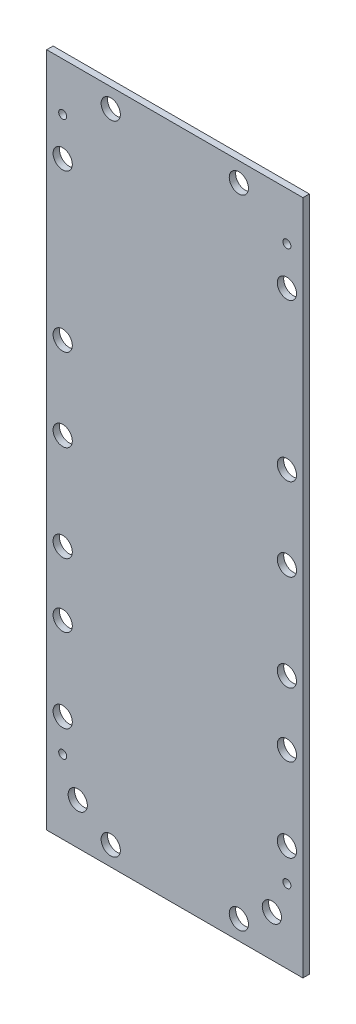
ISO-10303-21;
HEADER;
FILE_DESCRIPTION(('STEP AP214'),'2;1');
FILE_NAME('part.step','',(''),(''),'','','');
FILE_SCHEMA(('AUTOMOTIVE_DESIGN { 1 0 10303 214 1 1 1 1 }'));
ENDSEC;
DATA;
#1=APPLICATION_CONTEXT('core data for automotive mechanical design processes');
#2=APPLICATION_PROTOCOL_DEFINITION('international standard','automotive_design',2000,#1);
#3=PRODUCT_CONTEXT('',#1,'mechanical');
#4=PRODUCT('Part','Part','',(#3));
#5=PRODUCT_RELATED_PRODUCT_CATEGORY('part','',(#4));
#6=PRODUCT_DEFINITION_FORMATION('','',#4);
#7=PRODUCT_DEFINITION_CONTEXT('part definition',#1,'design');
#8=PRODUCT_DEFINITION('design','',#6,#7);
#9=PRODUCT_DEFINITION_SHAPE('','',#8);
#10=(LENGTH_UNIT() NAMED_UNIT(*) SI_UNIT(.MILLI.,.METRE.));
#11=(NAMED_UNIT(*) PLANE_ANGLE_UNIT() SI_UNIT($,.RADIAN.));
#12=(NAMED_UNIT(*) SI_UNIT($,.STERADIAN.) SOLID_ANGLE_UNIT());
#13=UNCERTAINTY_MEASURE_WITH_UNIT(LENGTH_MEASURE(1.E-05),#10,'distance_accuracy_value','');
#14=(GEOMETRIC_REPRESENTATION_CONTEXT(3) GLOBAL_UNCERTAINTY_ASSIGNED_CONTEXT((#13)) GLOBAL_UNIT_ASSIGNED_CONTEXT((#10,
#11,#12)) REPRESENTATION_CONTEXT('',''));
#15=CARTESIAN_POINT('',(0.,0.,0.));
#16=DIRECTION('',(0.,0.,1.));
#17=DIRECTION('',(1.,0.,0.));
#18=AXIS2_PLACEMENT_3D('',#15,#16,#17);
#19=CARTESIAN_POINT('',(80.,0.,2.));
#20=DIRECTION('',(0.,1.,0.));
#21=DIRECTION('',(0.,0.,1.));
#22=AXIS2_PLACEMENT_3D('',#19,#20,#21);
#23=PLANE('',#22);
#24=DIRECTION('',(1.,0.,0.));
#25=VECTOR('',#24,1.);
#26=CARTESIAN_POINT('',(80.,0.,0.));
#27=LINE('',#26,#25);
#28=CARTESIAN_POINT('',(0.,0.,0.));
#29=VERTEX_POINT('',#28);
#30=CARTESIAN_POINT('',(80.,0.,0.));
#31=VERTEX_POINT('',#30);
#32=EDGE_CURVE('E104',#29,#31,#27,.T.);
#33=ORIENTED_EDGE('',*,*,#32,.T.);
#34=DIRECTION('',(0.,0.,-1.));
#35=VECTOR('',#34,1.);
#36=CARTESIAN_POINT('',(80.,0.,2.));
#37=LINE('',#36,#35);
#38=CARTESIAN_POINT('',(80.,0.,2.));
#39=VERTEX_POINT('',#38);
#40=EDGE_CURVE('E11',#39,#31,#37,.T.);
#41=ORIENTED_EDGE('',*,*,#40,.F.);
#42=DIRECTION('',(1.,0.,0.));
#43=VECTOR('',#42,1.);
#44=CARTESIAN_POINT('',(80.,0.,2.));
#45=LINE('',#44,#43);
#46=CARTESIAN_POINT('',(0.,0.,2.));
#47=VERTEX_POINT('',#46);
#48=EDGE_CURVE('E91',#47,#39,#45,.T.);
#49=ORIENTED_EDGE('',*,*,#48,.F.);
#50=DIRECTION('',(0.,0.,-1.));
#51=VECTOR('',#50,1.);
#52=CARTESIAN_POINT('',(0.,0.,2.));
#53=LINE('',#52,#51);
#54=EDGE_CURVE('E100',#47,#29,#53,.T.);
#55=ORIENTED_EDGE('',*,*,#54,.T.);
#56=EDGE_LOOP('',(#33,#41,#49,#55));
#57=FACE_BOUND('',#56,.T.);
#58=ADVANCED_FACE('F38',(#57),#23,.F.);
#59=CARTESIAN_POINT('',(80.,211.,2.));
#60=DIRECTION('',(-1.,0.,0.));
#61=DIRECTION('',(0.,0.,1.));
#62=AXIS2_PLACEMENT_3D('',#59,#60,#61);
#63=PLANE('',#62);
#64=DIRECTION('',(0.,1.,0.));
#65=VECTOR('',#64,1.);
#66=CARTESIAN_POINT('',(80.,211.,0.));
#67=LINE('',#66,#65);
#68=CARTESIAN_POINT('',(80.,211.,0.));
#69=VERTEX_POINT('',#68);
#70=EDGE_CURVE('E95',#31,#69,#67,.T.);
#71=ORIENTED_EDGE('',*,*,#70,.T.);
#72=DIRECTION('',(0.,0.,-1.));
#73=VECTOR('',#72,1.);
#74=CARTESIAN_POINT('',(80.,211.,2.));
#75=LINE('',#74,#73);
#76=CARTESIAN_POINT('',(80.,211.,2.));
#77=VERTEX_POINT('',#76);
#78=EDGE_CURVE('E47',#77,#69,#75,.T.);
#79=ORIENTED_EDGE('',*,*,#78,.F.);
#80=DIRECTION('',(0.,1.,0.));
#81=VECTOR('',#80,1.);
#82=CARTESIAN_POINT('',(80.,211.,2.));
#83=LINE('',#82,#81);
#84=EDGE_CURVE('E86',#39,#77,#83,.T.);
#85=ORIENTED_EDGE('',*,*,#84,.F.);
#86=ORIENTED_EDGE('',*,*,#40,.T.);
#87=EDGE_LOOP('',(#71,#79,#85,#86));
#88=FACE_BOUND('',#87,.T.);
#89=ADVANCED_FACE('F94',(#88),#63,.F.);
#90=CARTESIAN_POINT('',(0.,211.,2.));
#91=DIRECTION('',(0.,-1.,0.));
#92=DIRECTION('',(0.,0.,-1.));
#93=AXIS2_PLACEMENT_3D('',#90,#91,#92);
#94=PLANE('',#93);
#95=DIRECTION('',(-1.,0.,0.));
#96=VECTOR('',#95,1.);
#97=CARTESIAN_POINT('',(0.,211.,0.));
#98=LINE('',#97,#96);
#99=CARTESIAN_POINT('',(0.,211.,0.));
#100=VERTEX_POINT('',#99);
#101=EDGE_CURVE('E73',#69,#100,#98,.T.);
#102=ORIENTED_EDGE('',*,*,#101,.T.);
#103=DIRECTION('',(0.,0.,-1.));
#104=VECTOR('',#103,1.);
#105=CARTESIAN_POINT('',(0.,211.,2.));
#106=LINE('',#105,#104);
#107=CARTESIAN_POINT('',(0.,211.,2.));
#108=VERTEX_POINT('',#107);
#109=EDGE_CURVE('E96',#108,#100,#106,.T.);
#110=ORIENTED_EDGE('',*,*,#109,.F.);
#111=DIRECTION('',(-1.,0.,0.));
#112=VECTOR('',#111,1.);
#113=CARTESIAN_POINT('',(0.,211.,2.));
#114=LINE('',#113,#112);
#115=EDGE_CURVE('E89',#77,#108,#114,.T.);
#116=ORIENTED_EDGE('',*,*,#115,.F.);
#117=ORIENTED_EDGE('',*,*,#78,.T.);
#118=EDGE_LOOP('',(#102,#110,#116,#117));
#119=FACE_BOUND('',#118,.T.);
#120=ADVANCED_FACE('F98',(#119),#94,.F.);
#121=CARTESIAN_POINT('',(0.,0.,2.));
#122=DIRECTION('',(1.,0.,0.));
#123=DIRECTION('',(0.,0.,-1.));
#124=AXIS2_PLACEMENT_3D('',#121,#122,#123);
#125=PLANE('',#124);
#126=DIRECTION('',(0.,-1.,0.));
#127=VECTOR('',#126,1.);
#128=CARTESIAN_POINT('',(0.,0.,0.));
#129=LINE('',#128,#127);
#130=EDGE_CURVE('E79',#100,#29,#129,.T.);
#131=ORIENTED_EDGE('',*,*,#130,.T.);
#132=ORIENTED_EDGE('',*,*,#54,.F.);
#133=DIRECTION('',(0.,-1.,0.));
#134=VECTOR('',#133,1.);
#135=CARTESIAN_POINT('',(0.,0.,2.));
#136=LINE('',#135,#134);
#137=EDGE_CURVE('E56',#108,#47,#136,.T.);
#138=ORIENTED_EDGE('',*,*,#137,.F.);
#139=ORIENTED_EDGE('',*,*,#109,.T.);
#140=EDGE_LOOP('',(#131,#132,#138,#139));
#141=FACE_BOUND('',#140,.T.);
#142=ADVANCED_FACE('F156',(#141),#125,.F.);
#143=CARTESIAN_POINT('',(0.,0.,2.));
#144=DIRECTION('',(0.,0.,-1.));
#145=DIRECTION('',(-1.,0.,0.));
#146=AXIS2_PLACEMENT_3D('',#143,#144,#145);
#147=PLANE('',#146);
#148=CARTESIAN_POINT('',(20.,205.,2.));
#149=DIRECTION('',(0.,0.,-1.));
#150=DIRECTION('',(-1.,0.,0.));
#151=AXIS2_PLACEMENT_3D('',#148,#149,#150);
#152=CIRCLE('',#151,3.);
#153=CARTESIAN_POINT('',(17.,205.,2.));
#154=VERTEX_POINT('',#153);
#155=EDGE_CURVE('E407',#154,#154,#152,.F.);
#156=ORIENTED_EDGE('',*,*,#155,.F.);
#157=EDGE_LOOP('',(#156));
#158=FACE_BOUND('',#157,.T.);
#159=CARTESIAN_POINT('',(4.99999999999998,33.2,2.));
#160=DIRECTION('',(0.,0.,-1.));
#161=DIRECTION('',(-1.,0.,0.));
#162=AXIS2_PLACEMENT_3D('',#159,#160,#161);
#163=CIRCLE('',#162,3.);
#164=CARTESIAN_POINT('',(1.99999999999998,33.2,2.));
#165=VERTEX_POINT('',#164);
#166=EDGE_CURVE('E419',#165,#165,#163,.F.);
#167=ORIENTED_EDGE('',*,*,#166,.F.);
#168=EDGE_LOOP('',(#167));
#169=FACE_BOUND('',#168,.T.);
#170=CARTESIAN_POINT('',(4.99999999999999,59.2,2.));
#171=DIRECTION('',(0.,0.,-1.));
#172=DIRECTION('',(-1.,0.,0.));
#173=AXIS2_PLACEMENT_3D('',#170,#171,#172);
#174=CIRCLE('',#173,3.);
#175=CARTESIAN_POINT('',(1.99999999999998,59.2,2.));
#176=VERTEX_POINT('',#175);
#177=EDGE_CURVE('E426',#176,#176,#174,.F.);
#178=ORIENTED_EDGE('',*,*,#177,.F.);
#179=EDGE_LOOP('',(#178));
#180=FACE_BOUND('',#179,.T.);
#181=CARTESIAN_POINT('',(5.00000000000002,79.2,2.));
#182=DIRECTION('',(0.,0.,-1.));
#183=DIRECTION('',(-1.,0.,0.));
#184=AXIS2_PLACEMENT_3D('',#181,#182,#183);
#185=CIRCLE('',#184,3.);
#186=CARTESIAN_POINT('',(2.00000000000001,79.2,2.));
#187=VERTEX_POINT('',#186);
#188=EDGE_CURVE('E425',#187,#187,#185,.F.);
#189=ORIENTED_EDGE('',*,*,#188,.F.);
#190=EDGE_LOOP('',(#189));
#191=FACE_BOUND('',#190,.T.);
#192=CARTESIAN_POINT('',(60.,5.99999999999999,2.));
#193=DIRECTION('',(0.,0.,-1.));
#194=DIRECTION('',(-1.,0.,0.));
#195=AXIS2_PLACEMENT_3D('',#192,#193,#194);
#196=CIRCLE('',#195,3.);
#197=CARTESIAN_POINT('',(57.,5.99999999999999,2.));
#198=VERTEX_POINT('',#197);
#199=EDGE_CURVE('E411',#198,#198,#196,.F.);
#200=ORIENTED_EDGE('',*,*,#199,.F.);
#201=EDGE_LOOP('',(#200));
#202=FACE_BOUND('',#201,.T.);
#203=CARTESIAN_POINT('',(20.,5.99999999999999,2.));
#204=DIRECTION('',(0.,0.,-1.));
#205=DIRECTION('',(-1.,0.,0.));
#206=AXIS2_PLACEMENT_3D('',#203,#204,#205);
#207=CIRCLE('',#206,2.99999999999999);
#208=CARTESIAN_POINT('',(17.,5.99999999999999,2.));
#209=VERTEX_POINT('',#208);
#210=EDGE_CURVE('E535',#209,#209,#207,.F.);
#211=ORIENTED_EDGE('',*,*,#210,.F.);
#212=EDGE_LOOP('',(#211));
#213=FACE_BOUND('',#212,.T.);
#214=CARTESIAN_POINT('',(70.3,13.,2.));
#215=DIRECTION('',(0.,0.,-1.));
#216=DIRECTION('',(-1.,0.,0.));
#217=AXIS2_PLACEMENT_3D('',#214,#215,#216);
#218=CIRCLE('',#217,3.00000000000001);
#219=CARTESIAN_POINT('',(67.3,13.,2.));
#220=VERTEX_POINT('',#219);
#221=EDGE_CURVE('E540',#220,#220,#218,.F.);
#222=ORIENTED_EDGE('',*,*,#221,.F.);
#223=EDGE_LOOP('',(#222));
#224=FACE_BOUND('',#223,.T.);
#225=CARTESIAN_POINT('',(60.,205.,2.));
#226=DIRECTION('',(0.,0.,-1.));
#227=DIRECTION('',(-1.,0.,0.));
#228=AXIS2_PLACEMENT_3D('',#225,#226,#227);
#229=CIRCLE('',#228,3.);
#230=CARTESIAN_POINT('',(57.,205.,2.));
#231=VERTEX_POINT('',#230);
#232=EDGE_CURVE('E529',#231,#231,#229,.F.);
#233=ORIENTED_EDGE('',*,*,#232,.F.);
#234=EDGE_LOOP('',(#233));
#235=FACE_BOUND('',#234,.T.);
#236=CARTESIAN_POINT('',(75.,135.,2.));
#237=DIRECTION('',(0.,0.,-1.));
#238=DIRECTION('',(-1.,0.,0.));
#239=AXIS2_PLACEMENT_3D('',#236,#237,#238);
#240=CIRCLE('',#239,3.00000000000001);
#241=CARTESIAN_POINT('',(72.,135.,2.));
#242=VERTEX_POINT('',#241);
#243=EDGE_CURVE('E462',#242,#242,#240,.F.);
#244=ORIENTED_EDGE('',*,*,#243,.F.);
#245=EDGE_LOOP('',(#244));
#246=FACE_BOUND('',#245,.T.);
#247=CARTESIAN_POINT('',(75.,109.2,2.));
#248=DIRECTION('',(0.,0.,-1.));
#249=DIRECTION('',(-1.,0.,0.));
#250=AXIS2_PLACEMENT_3D('',#247,#248,#249);
#251=CIRCLE('',#250,3.00000000000001);
#252=CARTESIAN_POINT('',(72.,109.2,2.));
#253=VERTEX_POINT('',#252);
#254=EDGE_CURVE('E463',#253,#253,#251,.F.);
#255=ORIENTED_EDGE('',*,*,#254,.F.);
#256=EDGE_LOOP('',(#255));
#257=FACE_BOUND('',#256,.T.);
#258=CARTESIAN_POINT('',(75.,79.2,2.));
#259=DIRECTION('',(0.,0.,-1.));
#260=DIRECTION('',(-1.,0.,0.));
#261=AXIS2_PLACEMENT_3D('',#258,#259,#260);
#262=CIRCLE('',#261,3.00000000000001);
#263=CARTESIAN_POINT('',(72.,79.2,2.));
#264=VERTEX_POINT('',#263);
#265=EDGE_CURVE('E470',#264,#264,#262,.F.);
#266=ORIENTED_EDGE('',*,*,#265,.F.);
#267=EDGE_LOOP('',(#266));
#268=FACE_BOUND('',#267,.T.);
#269=CARTESIAN_POINT('',(75.,59.2,2.));
#270=DIRECTION('',(0.,0.,-1.));
#271=DIRECTION('',(-1.,0.,0.));
#272=AXIS2_PLACEMENT_3D('',#269,#270,#271);
#273=CIRCLE('',#272,3.00000000000001);
#274=CARTESIAN_POINT('',(72.,59.2,2.));
#275=VERTEX_POINT('',#274);
#276=EDGE_CURVE('E476',#275,#275,#273,.F.);
#277=ORIENTED_EDGE('',*,*,#276,.F.);
#278=EDGE_LOOP('',(#277));
#279=FACE_BOUND('',#278,.T.);
#280=CARTESIAN_POINT('',(5.00000000000002,109.2,2.));
#281=DIRECTION('',(0.,0.,-1.));
#282=DIRECTION('',(-1.,0.,0.));
#283=AXIS2_PLACEMENT_3D('',#280,#281,#282);
#284=CIRCLE('',#283,3.);
#285=CARTESIAN_POINT('',(2.00000000000002,109.2,2.));
#286=VERTEX_POINT('',#285);
#287=EDGE_CURVE('E439',#286,#286,#284,.F.);
#288=ORIENTED_EDGE('',*,*,#287,.F.);
#289=EDGE_LOOP('',(#288));
#290=FACE_BOUND('',#289,.T.);
#291=CARTESIAN_POINT('',(4.99999999999999,135.,2.));
#292=DIRECTION('',(0.,0.,-1.));
#293=DIRECTION('',(-1.,0.,0.));
#294=AXIS2_PLACEMENT_3D('',#291,#292,#293);
#295=CIRCLE('',#294,3.);
#296=CARTESIAN_POINT('',(1.99999999999999,135.,2.));
#297=VERTEX_POINT('',#296);
#298=EDGE_CURVE('E438',#297,#297,#295,.F.);
#299=ORIENTED_EDGE('',*,*,#298,.F.);
#300=EDGE_LOOP('',(#299));
#301=FACE_BOUND('',#300,.T.);
#302=CARTESIAN_POINT('',(5.,184.,2.));
#303=DIRECTION('',(0.,0.,-1.));
#304=DIRECTION('',(-1.,0.,0.));
#305=AXIS2_PLACEMENT_3D('',#302,#303,#304);
#306=CIRCLE('',#305,3.);
#307=CARTESIAN_POINT('',(2.,184.,2.));
#308=VERTEX_POINT('',#307);
#309=EDGE_CURVE('E451',#308,#308,#306,.F.);
#310=ORIENTED_EDGE('',*,*,#309,.F.);
#311=EDGE_LOOP('',(#310));
#312=FACE_BOUND('',#311,.T.);
#313=CARTESIAN_POINT('',(75.,33.2,2.));
#314=DIRECTION('',(0.,0.,-1.));
#315=DIRECTION('',(-1.,0.,0.));
#316=AXIS2_PLACEMENT_3D('',#313,#314,#315);
#317=CIRCLE('',#316,3.00000000000001);
#318=CARTESIAN_POINT('',(72.,33.2,2.));
#319=VERTEX_POINT('',#318);
#320=EDGE_CURVE('E450',#319,#319,#317,.F.);
#321=ORIENTED_EDGE('',*,*,#320,.F.);
#322=EDGE_LOOP('',(#321));
#323=FACE_BOUND('',#322,.T.);
#324=CARTESIAN_POINT('',(9.7,13.,2.));
#325=DIRECTION('',(0.,0.,-1.));
#326=DIRECTION('',(-1.,0.,0.));
#327=AXIS2_PLACEMENT_3D('',#324,#325,#326);
#328=CIRCLE('',#327,3.);
#329=CARTESIAN_POINT('',(6.7,13.,2.));
#330=VERTEX_POINT('',#329);
#331=EDGE_CURVE('E524',#330,#330,#328,.F.);
#332=ORIENTED_EDGE('',*,*,#331,.F.);
#333=EDGE_LOOP('',(#332));
#334=FACE_BOUND('',#333,.T.);
#335=CARTESIAN_POINT('',(75.,184.,2.));
#336=DIRECTION('',(0.,0.,-1.));
#337=DIRECTION('',(-1.,0.,0.));
#338=AXIS2_PLACEMENT_3D('',#335,#336,#337);
#339=CIRCLE('',#338,3.00000000000001);
#340=CARTESIAN_POINT('',(72.,184.,2.));
#341=VERTEX_POINT('',#340);
#342=EDGE_CURVE('E485',#341,#341,#339,.F.);
#343=ORIENTED_EDGE('',*,*,#342,.F.);
#344=EDGE_LOOP('',(#343));
#345=FACE_BOUND('',#344,.T.);
#346=CARTESIAN_POINT('',(75.,196.,2.));
#347=DIRECTION('',(0.,0.,-1.));
#348=DIRECTION('',(-1.,0.,0.));
#349=AXIS2_PLACEMENT_3D('',#346,#347,#348);
#350=CIRCLE('',#349,1.25);
#351=CARTESIAN_POINT('',(73.75,196.,2.));
#352=VERTEX_POINT('',#351);
#353=EDGE_CURVE('E41',#352,#352,#350,.T.);
#354=ORIENTED_EDGE('',*,*,#353,.T.);
#355=EDGE_LOOP('',(#354));
#356=FACE_BOUND('',#355,.T.);
#357=CARTESIAN_POINT('',(5.00000000000003,196.,2.));
#358=DIRECTION('',(0.,0.,-1.));
#359=DIRECTION('',(-1.,0.,0.));
#360=AXIS2_PLACEMENT_3D('',#357,#358,#359);
#361=CIRCLE('',#360,1.25);
#362=CARTESIAN_POINT('',(3.75000000000003,196.,2.));
#363=VERTEX_POINT('',#362);
#364=EDGE_CURVE('E121',#363,#363,#361,.T.);
#365=ORIENTED_EDGE('',*,*,#364,.T.);
#366=EDGE_LOOP('',(#365));
#367=FACE_BOUND('',#366,.T.);
#368=CARTESIAN_POINT('',(75.,23.,2.));
#369=DIRECTION('',(0.,0.,-1.));
#370=DIRECTION('',(-1.,0.,0.));
#371=AXIS2_PLACEMENT_3D('',#368,#369,#370);
#372=CIRCLE('',#371,1.25);
#373=CARTESIAN_POINT('',(73.75,23.,2.));
#374=VERTEX_POINT('',#373);
#375=EDGE_CURVE('E112',#374,#374,#372,.T.);
#376=ORIENTED_EDGE('',*,*,#375,.T.);
#377=EDGE_LOOP('',(#376));
#378=FACE_BOUND('',#377,.T.);
#379=CARTESIAN_POINT('',(5.00000000000003,23.,2.));
#380=DIRECTION('',(0.,0.,-1.));
#381=DIRECTION('',(-1.,0.,0.));
#382=AXIS2_PLACEMENT_3D('',#379,#380,#381);
#383=CIRCLE('',#382,1.25);
#384=CARTESIAN_POINT('',(3.75000000000003,23.,2.));
#385=VERTEX_POINT('',#384);
#386=EDGE_CURVE('E107',#385,#385,#383,.T.);
#387=ORIENTED_EDGE('',*,*,#386,.T.);
#388=EDGE_LOOP('',(#387));
#389=FACE_BOUND('',#388,.T.);
#390=ORIENTED_EDGE('',*,*,#48,.T.);
#391=ORIENTED_EDGE('',*,*,#84,.T.);
#392=ORIENTED_EDGE('',*,*,#115,.T.);
#393=ORIENTED_EDGE('',*,*,#137,.T.);
#394=EDGE_LOOP('',(#390,#391,#392,#393));
#395=FACE_BOUND('',#394,.T.);
#396=ADVANCED_FACE('F87',(#158,#169,#180,#191,#202,#213,#224,#235,#246,#257,#268,#279,#290,#301,
#312,#323,#334,#345,#356,#367,#378,#389,#395),#147,.F.);
#397=CARTESIAN_POINT('',(0.,0.,0.));
#398=DIRECTION('',(0.,0.,-1.));
#399=DIRECTION('',(-1.,0.,0.));
#400=AXIS2_PLACEMENT_3D('',#397,#398,#399);
#401=PLANE('',#400);
#402=CARTESIAN_POINT('',(20.,205.,0.));
#403=DIRECTION('',(0.,0.,-1.));
#404=DIRECTION('',(-1.,0.,0.));
#405=AXIS2_PLACEMENT_3D('',#402,#403,#404);
#406=CIRCLE('',#405,3.);
#407=CARTESIAN_POINT('',(17.,205.,0.));
#408=VERTEX_POINT('',#407);
#409=EDGE_CURVE('E410',#408,#408,#406,.T.);
#410=ORIENTED_EDGE('',*,*,#409,.F.);
#411=EDGE_LOOP('',(#410));
#412=FACE_BOUND('',#411,.T.);
#413=CARTESIAN_POINT('',(4.99999999999998,33.2,0.));
#414=DIRECTION('',(0.,0.,-1.));
#415=DIRECTION('',(-1.,0.,0.));
#416=AXIS2_PLACEMENT_3D('',#413,#414,#415);
#417=CIRCLE('',#416,3.);
#418=CARTESIAN_POINT('',(1.99999999999998,33.2,0.));
#419=VERTEX_POINT('',#418);
#420=EDGE_CURVE('E413',#419,#419,#417,.T.);
#421=ORIENTED_EDGE('',*,*,#420,.F.);
#422=EDGE_LOOP('',(#421));
#423=FACE_BOUND('',#422,.T.);
#424=CARTESIAN_POINT('',(4.99999999999999,59.2,0.));
#425=DIRECTION('',(0.,0.,-1.));
#426=DIRECTION('',(-1.,0.,0.));
#427=AXIS2_PLACEMENT_3D('',#424,#425,#426);
#428=CIRCLE('',#427,3.);
#429=CARTESIAN_POINT('',(1.99999999999998,59.2,0.));
#430=VERTEX_POINT('',#429);
#431=EDGE_CURVE('E430',#430,#430,#428,.T.);
#432=ORIENTED_EDGE('',*,*,#431,.F.);
#433=EDGE_LOOP('',(#432));
#434=FACE_BOUND('',#433,.T.);
#435=CARTESIAN_POINT('',(5.00000000000002,79.2,0.));
#436=DIRECTION('',(0.,0.,-1.));
#437=DIRECTION('',(-1.,0.,0.));
#438=AXIS2_PLACEMENT_3D('',#435,#436,#437);
#439=CIRCLE('',#438,3.);
#440=CARTESIAN_POINT('',(2.00000000000001,79.2,0.));
#441=VERTEX_POINT('',#440);
#442=EDGE_CURVE('E422',#441,#441,#439,.T.);
#443=ORIENTED_EDGE('',*,*,#442,.F.);
#444=EDGE_LOOP('',(#443));
#445=FACE_BOUND('',#444,.T.);
#446=CARTESIAN_POINT('',(60.,5.99999999999999,0.));
#447=DIRECTION('',(0.,0.,-1.));
#448=DIRECTION('',(-1.,0.,0.));
#449=AXIS2_PLACEMENT_3D('',#446,#447,#448);
#450=CIRCLE('',#449,3.);
#451=CARTESIAN_POINT('',(57.,5.99999999999999,0.));
#452=VERTEX_POINT('',#451);
#453=EDGE_CURVE('E416',#452,#452,#450,.T.);
#454=ORIENTED_EDGE('',*,*,#453,.F.);
#455=EDGE_LOOP('',(#454));
#456=FACE_BOUND('',#455,.T.);
#457=CARTESIAN_POINT('',(20.,5.99999999999999,0.));
#458=DIRECTION('',(0.,0.,-1.));
#459=DIRECTION('',(-1.,0.,0.));
#460=AXIS2_PLACEMENT_3D('',#457,#458,#459);
#461=CIRCLE('',#460,2.99999999999999);
#462=CARTESIAN_POINT('',(17.,5.99999999999999,0.));
#463=VERTEX_POINT('',#462);
#464=EDGE_CURVE('E537',#463,#463,#461,.T.);
#465=ORIENTED_EDGE('',*,*,#464,.F.);
#466=EDGE_LOOP('',(#465));
#467=FACE_BOUND('',#466,.T.);
#468=CARTESIAN_POINT('',(70.3,13.,0.));
#469=DIRECTION('',(0.,0.,-1.));
#470=DIRECTION('',(-1.,0.,0.));
#471=AXIS2_PLACEMENT_3D('',#468,#469,#470);
#472=CIRCLE('',#471,3.00000000000001);
#473=CARTESIAN_POINT('',(67.3,13.,0.));
#474=VERTEX_POINT('',#473);
#475=EDGE_CURVE('E543',#474,#474,#472,.T.);
#476=ORIENTED_EDGE('',*,*,#475,.F.);
#477=EDGE_LOOP('',(#476));
#478=FACE_BOUND('',#477,.T.);
#479=CARTESIAN_POINT('',(60.,205.,0.));
#480=DIRECTION('',(0.,0.,-1.));
#481=DIRECTION('',(-1.,0.,0.));
#482=AXIS2_PLACEMENT_3D('',#479,#480,#481);
#483=CIRCLE('',#482,3.);
#484=CARTESIAN_POINT('',(57.,205.,0.));
#485=VERTEX_POINT('',#484);
#486=EDGE_CURVE('E525',#485,#485,#483,.T.);
#487=ORIENTED_EDGE('',*,*,#486,.F.);
#488=EDGE_LOOP('',(#487));
#489=FACE_BOUND('',#488,.T.);
#490=CARTESIAN_POINT('',(75.,135.,0.));
#491=DIRECTION('',(0.,0.,-1.));
#492=DIRECTION('',(-1.,0.,0.));
#493=AXIS2_PLACEMENT_3D('',#490,#491,#492);
#494=CIRCLE('',#493,3.00000000000001);
#495=CARTESIAN_POINT('',(72.,135.,0.));
#496=VERTEX_POINT('',#495);
#497=EDGE_CURVE('E459',#496,#496,#494,.T.);
#498=ORIENTED_EDGE('',*,*,#497,.F.);
#499=EDGE_LOOP('',(#498));
#500=FACE_BOUND('',#499,.T.);
#501=CARTESIAN_POINT('',(75.,109.2,0.));
#502=DIRECTION('',(0.,0.,-1.));
#503=DIRECTION('',(-1.,0.,0.));
#504=AXIS2_PLACEMENT_3D('',#501,#502,#503);
#505=CIRCLE('',#504,3.00000000000001);
#506=CARTESIAN_POINT('',(72.,109.2,0.));
#507=VERTEX_POINT('',#506);
#508=EDGE_CURVE('E467',#507,#507,#505,.T.);
#509=ORIENTED_EDGE('',*,*,#508,.F.);
#510=EDGE_LOOP('',(#509));
#511=FACE_BOUND('',#510,.T.);
#512=CARTESIAN_POINT('',(75.,79.2,0.));
#513=DIRECTION('',(0.,0.,-1.));
#514=DIRECTION('',(-1.,0.,0.));
#515=AXIS2_PLACEMENT_3D('',#512,#513,#514);
#516=CIRCLE('',#515,3.00000000000001);
#517=CARTESIAN_POINT('',(72.,79.2,0.));
#518=VERTEX_POINT('',#517);
#519=EDGE_CURVE('E473',#518,#518,#516,.T.);
#520=ORIENTED_EDGE('',*,*,#519,.F.);
#521=EDGE_LOOP('',(#520));
#522=FACE_BOUND('',#521,.T.);
#523=CARTESIAN_POINT('',(75.,59.2,0.));
#524=DIRECTION('',(0.,0.,-1.));
#525=DIRECTION('',(-1.,0.,0.));
#526=AXIS2_PLACEMENT_3D('',#523,#524,#525);
#527=CIRCLE('',#526,3.00000000000001);
#528=CARTESIAN_POINT('',(72.,59.2,0.));
#529=VERTEX_POINT('',#528);
#530=EDGE_CURVE('E454',#529,#529,#527,.T.);
#531=ORIENTED_EDGE('',*,*,#530,.F.);
#532=EDGE_LOOP('',(#531));
#533=FACE_BOUND('',#532,.T.);
#534=CARTESIAN_POINT('',(5.00000000000002,109.2,0.));
#535=DIRECTION('',(0.,0.,-1.));
#536=DIRECTION('',(-1.,0.,0.));
#537=AXIS2_PLACEMENT_3D('',#534,#535,#536);
#538=CIRCLE('',#537,3.);
#539=CARTESIAN_POINT('',(2.00000000000002,109.2,0.));
#540=VERTEX_POINT('',#539);
#541=EDGE_CURVE('E429',#540,#540,#538,.T.);
#542=ORIENTED_EDGE('',*,*,#541,.F.);
#543=EDGE_LOOP('',(#542));
#544=FACE_BOUND('',#543,.T.);
#545=CARTESIAN_POINT('',(4.99999999999999,135.,0.));
#546=DIRECTION('',(0.,0.,-1.));
#547=DIRECTION('',(-1.,0.,0.));
#548=AXIS2_PLACEMENT_3D('',#545,#546,#547);
#549=CIRCLE('',#548,3.);
#550=CARTESIAN_POINT('',(1.99999999999999,135.,0.));
#551=VERTEX_POINT('',#550);
#552=EDGE_CURVE('E435',#551,#551,#549,.T.);
#553=ORIENTED_EDGE('',*,*,#552,.F.);
#554=EDGE_LOOP('',(#553));
#555=FACE_BOUND('',#554,.T.);
#556=CARTESIAN_POINT('',(5.,184.,0.));
#557=DIRECTION('',(0.,0.,-1.));
#558=DIRECTION('',(-1.,0.,0.));
#559=AXIS2_PLACEMENT_3D('',#556,#557,#558);
#560=CIRCLE('',#559,3.);
#561=CARTESIAN_POINT('',(2.,184.,0.));
#562=VERTEX_POINT('',#561);
#563=EDGE_CURVE('E442',#562,#562,#560,.T.);
#564=ORIENTED_EDGE('',*,*,#563,.F.);
#565=EDGE_LOOP('',(#564));
#566=FACE_BOUND('',#565,.T.);
#567=CARTESIAN_POINT('',(75.,33.2,0.));
#568=DIRECTION('',(0.,0.,-1.));
#569=DIRECTION('',(-1.,0.,0.));
#570=AXIS2_PLACEMENT_3D('',#567,#568,#569);
#571=CIRCLE('',#570,3.00000000000001);
#572=CARTESIAN_POINT('',(72.,33.2,0.));
#573=VERTEX_POINT('',#572);
#574=EDGE_CURVE('E447',#573,#573,#571,.T.);
#575=ORIENTED_EDGE('',*,*,#574,.F.);
#576=EDGE_LOOP('',(#575));
#577=FACE_BOUND('',#576,.T.);
#578=CARTESIAN_POINT('',(9.7,13.,0.));
#579=DIRECTION('',(0.,0.,-1.));
#580=DIRECTION('',(-1.,0.,0.));
#581=AXIS2_PLACEMENT_3D('',#578,#579,#580);
#582=CIRCLE('',#581,3.);
#583=CARTESIAN_POINT('',(6.7,13.,0.));
#584=VERTEX_POINT('',#583);
#585=EDGE_CURVE('E526',#584,#584,#582,.T.);
#586=ORIENTED_EDGE('',*,*,#585,.F.);
#587=EDGE_LOOP('',(#586));
#588=FACE_BOUND('',#587,.T.);
#589=CARTESIAN_POINT('',(75.,184.,0.));
#590=DIRECTION('',(0.,0.,-1.));
#591=DIRECTION('',(-1.,0.,0.));
#592=AXIS2_PLACEMENT_3D('',#589,#590,#591);
#593=CIRCLE('',#592,3.00000000000001);
#594=CARTESIAN_POINT('',(72.,184.,0.));
#595=VERTEX_POINT('',#594);
#596=EDGE_CURVE('E466',#595,#595,#593,.T.);
#597=ORIENTED_EDGE('',*,*,#596,.F.);
#598=EDGE_LOOP('',(#597));
#599=FACE_BOUND('',#598,.T.);
#600=CARTESIAN_POINT('',(75.,196.,0.));
#601=DIRECTION('',(0.,0.,-1.));
#602=DIRECTION('',(-1.,0.,0.));
#603=AXIS2_PLACEMENT_3D('',#600,#601,#602);
#604=CIRCLE('',#603,1.25);
#605=CARTESIAN_POINT('',(73.75,196.,0.));
#606=VERTEX_POINT('',#605);
#607=EDGE_CURVE('E488',#606,#606,#604,.T.);
#608=ORIENTED_EDGE('',*,*,#607,.F.);
#609=EDGE_LOOP('',(#608));
#610=FACE_BOUND('',#609,.T.);
#611=CARTESIAN_POINT('',(5.00000000000003,196.,0.));
#612=DIRECTION('',(0.,0.,-1.));
#613=DIRECTION('',(-1.,0.,0.));
#614=AXIS2_PLACEMENT_3D('',#611,#612,#613);
#615=CIRCLE('',#614,1.25);
#616=CARTESIAN_POINT('',(3.75000000000003,196.,0.));
#617=VERTEX_POINT('',#616);
#618=EDGE_CURVE('E126',#617,#617,#615,.T.);
#619=ORIENTED_EDGE('',*,*,#618,.F.);
#620=EDGE_LOOP('',(#619));
#621=FACE_BOUND('',#620,.T.);
#622=CARTESIAN_POINT('',(75.,23.,0.));
#623=DIRECTION('',(0.,0.,-1.));
#624=DIRECTION('',(-1.,0.,0.));
#625=AXIS2_PLACEMENT_3D('',#622,#623,#624);
#626=CIRCLE('',#625,1.25);
#627=CARTESIAN_POINT('',(73.75,23.,0.));
#628=VERTEX_POINT('',#627);
#629=EDGE_CURVE('E115',#628,#628,#626,.T.);
#630=ORIENTED_EDGE('',*,*,#629,.F.);
#631=EDGE_LOOP('',(#630));
#632=FACE_BOUND('',#631,.T.);
#633=CARTESIAN_POINT('',(5.00000000000003,23.,0.));
#634=DIRECTION('',(0.,0.,-1.));
#635=DIRECTION('',(-1.,0.,0.));
#636=AXIS2_PLACEMENT_3D('',#633,#634,#635);
#637=CIRCLE('',#636,1.25);
#638=CARTESIAN_POINT('',(3.75000000000003,23.,0.));
#639=VERTEX_POINT('',#638);
#640=EDGE_CURVE('E114',#639,#639,#637,.T.);
#641=ORIENTED_EDGE('',*,*,#640,.F.);
#642=EDGE_LOOP('',(#641));
#643=FACE_BOUND('',#642,.T.);
#644=ORIENTED_EDGE('',*,*,#32,.F.);
#645=ORIENTED_EDGE('',*,*,#130,.F.);
#646=ORIENTED_EDGE('',*,*,#101,.F.);
#647=ORIENTED_EDGE('',*,*,#70,.F.);
#648=EDGE_LOOP('',(#644,#645,#646,#647));
#649=FACE_BOUND('',#648,.T.);
#650=ADVANCED_FACE('F137',(#412,#423,#434,#445,#456,#467,#478,#489,#500,#511,#522,#533,#544,
#555,#566,#577,#588,#599,#610,#621,#632,#643,#649),#401,.T.);
#651=CARTESIAN_POINT('',(5.00000000000003,23.,0.));
#652=DIRECTION('',(0.,0.,-1.));
#653=DIRECTION('',(-1.,0.,0.));
#654=AXIS2_PLACEMENT_3D('',#651,#652,#653);
#655=CYLINDRICAL_SURFACE('',#654,1.25);
#656=ORIENTED_EDGE('',*,*,#640,.T.);
#657=EDGE_LOOP('',(#656));
#658=FACE_BOUND('',#657,.T.);
#659=ORIENTED_EDGE('',*,*,#386,.F.);
#660=EDGE_LOOP('',(#659));
#661=FACE_BOUND('',#660,.T.);
#662=ADVANCED_FACE('F134',(#658,#661),#655,.F.);
#663=CARTESIAN_POINT('',(75.,23.,0.));
#664=DIRECTION('',(0.,0.,-1.));
#665=DIRECTION('',(-1.,0.,0.));
#666=AXIS2_PLACEMENT_3D('',#663,#664,#665);
#667=CYLINDRICAL_SURFACE('',#666,1.25);
#668=ORIENTED_EDGE('',*,*,#629,.T.);
#669=EDGE_LOOP('',(#668));
#670=FACE_BOUND('',#669,.T.);
#671=ORIENTED_EDGE('',*,*,#375,.F.);
#672=EDGE_LOOP('',(#671));
#673=FACE_BOUND('',#672,.T.);
#674=ADVANCED_FACE('F136',(#670,#673),#667,.F.);
#675=CARTESIAN_POINT('',(5.00000000000003,196.,0.));
#676=DIRECTION('',(0.,0.,-1.));
#677=DIRECTION('',(-1.,0.,0.));
#678=AXIS2_PLACEMENT_3D('',#675,#676,#677);
#679=CYLINDRICAL_SURFACE('',#678,1.25);
#680=ORIENTED_EDGE('',*,*,#618,.T.);
#681=EDGE_LOOP('',(#680));
#682=FACE_BOUND('',#681,.T.);
#683=ORIENTED_EDGE('',*,*,#364,.F.);
#684=EDGE_LOOP('',(#683));
#685=FACE_BOUND('',#684,.T.);
#686=ADVANCED_FACE('F144',(#682,#685),#679,.F.);
#687=CARTESIAN_POINT('',(75.,196.,0.));
#688=DIRECTION('',(0.,0.,-1.));
#689=DIRECTION('',(-1.,0.,0.));
#690=AXIS2_PLACEMENT_3D('',#687,#688,#689);
#691=CYLINDRICAL_SURFACE('',#690,1.25);
#692=ORIENTED_EDGE('',*,*,#607,.T.);
#693=EDGE_LOOP('',(#692));
#694=FACE_BOUND('',#693,.T.);
#695=ORIENTED_EDGE('',*,*,#353,.F.);
#696=EDGE_LOOP('',(#695));
#697=FACE_BOUND('',#696,.T.);
#698=ADVANCED_FACE('F212',(#694,#697),#691,.F.);
#699=CARTESIAN_POINT('',(75.,184.,10.4852813742386));
#700=DIRECTION('',(0.,0.,-1.));
#701=DIRECTION('',(-1.,0.,0.));
#702=AXIS2_PLACEMENT_3D('',#699,#700,#701);
#703=CYLINDRICAL_SURFACE('',#702,3.00000000000001);
#704=ORIENTED_EDGE('',*,*,#342,.T.);
#705=EDGE_LOOP('',(#704));
#706=FACE_BOUND('',#705,.T.);
#707=ORIENTED_EDGE('',*,*,#596,.T.);
#708=EDGE_LOOP('',(#707));
#709=FACE_BOUND('',#708,.T.);
#710=ADVANCED_FACE('F220',(#706,#709),#703,.F.);
#711=CARTESIAN_POINT('',(9.7,13.,10.4852813742386));
#712=DIRECTION('',(0.,0.,-1.));
#713=DIRECTION('',(-1.,0.,0.));
#714=AXIS2_PLACEMENT_3D('',#711,#712,#713);
#715=CYLINDRICAL_SURFACE('',#714,3.);
#716=ORIENTED_EDGE('',*,*,#331,.T.);
#717=EDGE_LOOP('',(#716));
#718=FACE_BOUND('',#717,.T.);
#719=ORIENTED_EDGE('',*,*,#585,.T.);
#720=EDGE_LOOP('',(#719));
#721=FACE_BOUND('',#720,.T.);
#722=ADVANCED_FACE('F228',(#718,#721),#715,.F.);
#723=CARTESIAN_POINT('',(75.,33.2,10.4852813742386));
#724=DIRECTION('',(0.,0.,-1.));
#725=DIRECTION('',(-1.,0.,0.));
#726=AXIS2_PLACEMENT_3D('',#723,#724,#725);
#727=CYLINDRICAL_SURFACE('',#726,3.00000000000001);
#728=ORIENTED_EDGE('',*,*,#320,.T.);
#729=EDGE_LOOP('',(#728));
#730=FACE_BOUND('',#729,.T.);
#731=ORIENTED_EDGE('',*,*,#574,.T.);
#732=EDGE_LOOP('',(#731));
#733=FACE_BOUND('',#732,.T.);
#734=ADVANCED_FACE('F237',(#730,#733),#727,.F.);
#735=CARTESIAN_POINT('',(5.,184.,10.4852813742386));
#736=DIRECTION('',(0.,0.,-1.));
#737=DIRECTION('',(-1.,0.,0.));
#738=AXIS2_PLACEMENT_3D('',#735,#736,#737);
#739=CYLINDRICAL_SURFACE('',#738,3.);
#740=ORIENTED_EDGE('',*,*,#309,.T.);
#741=EDGE_LOOP('',(#740));
#742=FACE_BOUND('',#741,.T.);
#743=ORIENTED_EDGE('',*,*,#563,.T.);
#744=EDGE_LOOP('',(#743));
#745=FACE_BOUND('',#744,.T.);
#746=ADVANCED_FACE('F246',(#742,#745),#739,.F.);
#747=CARTESIAN_POINT('',(4.99999999999999,135.,10.4852813742386));
#748=DIRECTION('',(0.,0.,-1.));
#749=DIRECTION('',(-1.,0.,0.));
#750=AXIS2_PLACEMENT_3D('',#747,#748,#749);
#751=CYLINDRICAL_SURFACE('',#750,3.);
#752=ORIENTED_EDGE('',*,*,#298,.T.);
#753=EDGE_LOOP('',(#752));
#754=FACE_BOUND('',#753,.T.);
#755=ORIENTED_EDGE('',*,*,#552,.T.);
#756=EDGE_LOOP('',(#755));
#757=FACE_BOUND('',#756,.T.);
#758=ADVANCED_FACE('F255',(#754,#757),#751,.F.);
#759=CARTESIAN_POINT('',(5.00000000000002,109.2,10.4852813742386));
#760=DIRECTION('',(0.,0.,-1.));
#761=DIRECTION('',(-1.,0.,0.));
#762=AXIS2_PLACEMENT_3D('',#759,#760,#761);
#763=CYLINDRICAL_SURFACE('',#762,3.);
#764=ORIENTED_EDGE('',*,*,#287,.T.);
#765=EDGE_LOOP('',(#764));
#766=FACE_BOUND('',#765,.T.);
#767=ORIENTED_EDGE('',*,*,#541,.T.);
#768=EDGE_LOOP('',(#767));
#769=FACE_BOUND('',#768,.T.);
#770=ADVANCED_FACE('F264',(#766,#769),#763,.F.);
#771=CARTESIAN_POINT('',(75.,59.2,10.4852813742386));
#772=DIRECTION('',(0.,0.,-1.));
#773=DIRECTION('',(-1.,0.,0.));
#774=AXIS2_PLACEMENT_3D('',#771,#772,#773);
#775=CYLINDRICAL_SURFACE('',#774,3.00000000000001);
#776=ORIENTED_EDGE('',*,*,#276,.T.);
#777=EDGE_LOOP('',(#776));
#778=FACE_BOUND('',#777,.T.);
#779=ORIENTED_EDGE('',*,*,#530,.T.);
#780=EDGE_LOOP('',(#779));
#781=FACE_BOUND('',#780,.T.);
#782=ADVANCED_FACE('F273',(#778,#781),#775,.F.);
#783=CARTESIAN_POINT('',(75.,79.2,10.4852813742386));
#784=DIRECTION('',(0.,0.,-1.));
#785=DIRECTION('',(-1.,0.,0.));
#786=AXIS2_PLACEMENT_3D('',#783,#784,#785);
#787=CYLINDRICAL_SURFACE('',#786,3.00000000000001);
#788=ORIENTED_EDGE('',*,*,#265,.T.);
#789=EDGE_LOOP('',(#788));
#790=FACE_BOUND('',#789,.T.);
#791=ORIENTED_EDGE('',*,*,#519,.T.);
#792=EDGE_LOOP('',(#791));
#793=FACE_BOUND('',#792,.T.);
#794=ADVANCED_FACE('F282',(#790,#793),#787,.F.);
#795=CARTESIAN_POINT('',(75.,109.2,10.4852813742386));
#796=DIRECTION('',(0.,0.,-1.));
#797=DIRECTION('',(-1.,0.,0.));
#798=AXIS2_PLACEMENT_3D('',#795,#796,#797);
#799=CYLINDRICAL_SURFACE('',#798,3.00000000000001);
#800=ORIENTED_EDGE('',*,*,#254,.T.);
#801=EDGE_LOOP('',(#800));
#802=FACE_BOUND('',#801,.T.);
#803=ORIENTED_EDGE('',*,*,#508,.T.);
#804=EDGE_LOOP('',(#803));
#805=FACE_BOUND('',#804,.T.);
#806=ADVANCED_FACE('F291',(#802,#805),#799,.F.);
#807=CARTESIAN_POINT('',(75.,135.,10.4852813742386));
#808=DIRECTION('',(0.,0.,-1.));
#809=DIRECTION('',(-1.,0.,0.));
#810=AXIS2_PLACEMENT_3D('',#807,#808,#809);
#811=CYLINDRICAL_SURFACE('',#810,3.00000000000001);
#812=ORIENTED_EDGE('',*,*,#243,.T.);
#813=EDGE_LOOP('',(#812));
#814=FACE_BOUND('',#813,.T.);
#815=ORIENTED_EDGE('',*,*,#497,.T.);
#816=EDGE_LOOP('',(#815));
#817=FACE_BOUND('',#816,.T.);
#818=ADVANCED_FACE('F300',(#814,#817),#811,.F.);
#819=CARTESIAN_POINT('',(60.,205.,10.4852813742386));
#820=DIRECTION('',(0.,0.,-1.));
#821=DIRECTION('',(-1.,0.,0.));
#822=AXIS2_PLACEMENT_3D('',#819,#820,#821);
#823=CYLINDRICAL_SURFACE('',#822,3.);
#824=ORIENTED_EDGE('',*,*,#232,.T.);
#825=EDGE_LOOP('',(#824));
#826=FACE_BOUND('',#825,.T.);
#827=ORIENTED_EDGE('',*,*,#486,.T.);
#828=EDGE_LOOP('',(#827));
#829=FACE_BOUND('',#828,.T.);
#830=ADVANCED_FACE('F309',(#826,#829),#823,.F.);
#831=CARTESIAN_POINT('',(70.3,13.,10.4852813742386));
#832=DIRECTION('',(0.,0.,-1.));
#833=DIRECTION('',(-1.,0.,0.));
#834=AXIS2_PLACEMENT_3D('',#831,#832,#833);
#835=CYLINDRICAL_SURFACE('',#834,3.00000000000001);
#836=ORIENTED_EDGE('',*,*,#221,.T.);
#837=EDGE_LOOP('',(#836));
#838=FACE_BOUND('',#837,.T.);
#839=ORIENTED_EDGE('',*,*,#475,.T.);
#840=EDGE_LOOP('',(#839));
#841=FACE_BOUND('',#840,.T.);
#842=ADVANCED_FACE('F318',(#838,#841),#835,.F.);
#843=CARTESIAN_POINT('',(20.,5.99999999999999,10.4852813742386));
#844=DIRECTION('',(0.,0.,-1.));
#845=DIRECTION('',(-1.,0.,0.));
#846=AXIS2_PLACEMENT_3D('',#843,#844,#845);
#847=CYLINDRICAL_SURFACE('',#846,2.99999999999999);
#848=ORIENTED_EDGE('',*,*,#210,.T.);
#849=EDGE_LOOP('',(#848));
#850=FACE_BOUND('',#849,.T.);
#851=ORIENTED_EDGE('',*,*,#464,.T.);
#852=EDGE_LOOP('',(#851));
#853=FACE_BOUND('',#852,.T.);
#854=ADVANCED_FACE('F327',(#850,#853),#847,.F.);
#855=CARTESIAN_POINT('',(60.,5.99999999999999,10.4852813742386));
#856=DIRECTION('',(0.,0.,-1.));
#857=DIRECTION('',(-1.,0.,0.));
#858=AXIS2_PLACEMENT_3D('',#855,#856,#857);
#859=CYLINDRICAL_SURFACE('',#858,3.);
#860=ORIENTED_EDGE('',*,*,#199,.T.);
#861=EDGE_LOOP('',(#860));
#862=FACE_BOUND('',#861,.T.);
#863=ORIENTED_EDGE('',*,*,#453,.T.);
#864=EDGE_LOOP('',(#863));
#865=FACE_BOUND('',#864,.T.);
#866=ADVANCED_FACE('F336',(#862,#865),#859,.F.);
#867=CARTESIAN_POINT('',(5.00000000000002,79.2,10.4852813742386));
#868=DIRECTION('',(0.,0.,-1.));
#869=DIRECTION('',(-1.,0.,0.));
#870=AXIS2_PLACEMENT_3D('',#867,#868,#869);
#871=CYLINDRICAL_SURFACE('',#870,3.);
#872=ORIENTED_EDGE('',*,*,#188,.T.);
#873=EDGE_LOOP('',(#872));
#874=FACE_BOUND('',#873,.T.);
#875=ORIENTED_EDGE('',*,*,#442,.T.);
#876=EDGE_LOOP('',(#875));
#877=FACE_BOUND('',#876,.T.);
#878=ADVANCED_FACE('F345',(#874,#877),#871,.F.);
#879=CARTESIAN_POINT('',(4.99999999999999,59.2,10.4852813742386));
#880=DIRECTION('',(0.,0.,-1.));
#881=DIRECTION('',(-1.,0.,0.));
#882=AXIS2_PLACEMENT_3D('',#879,#880,#881);
#883=CYLINDRICAL_SURFACE('',#882,3.);
#884=ORIENTED_EDGE('',*,*,#177,.T.);
#885=EDGE_LOOP('',(#884));
#886=FACE_BOUND('',#885,.T.);
#887=ORIENTED_EDGE('',*,*,#431,.T.);
#888=EDGE_LOOP('',(#887));
#889=FACE_BOUND('',#888,.T.);
#890=ADVANCED_FACE('F354',(#886,#889),#883,.F.);
#891=CARTESIAN_POINT('',(4.99999999999998,33.2,10.4852813742386));
#892=DIRECTION('',(0.,0.,-1.));
#893=DIRECTION('',(-1.,0.,0.));
#894=AXIS2_PLACEMENT_3D('',#891,#892,#893);
#895=CYLINDRICAL_SURFACE('',#894,3.);
#896=ORIENTED_EDGE('',*,*,#166,.T.);
#897=EDGE_LOOP('',(#896));
#898=FACE_BOUND('',#897,.T.);
#899=ORIENTED_EDGE('',*,*,#420,.T.);
#900=EDGE_LOOP('',(#899));
#901=FACE_BOUND('',#900,.T.);
#902=ADVANCED_FACE('F363',(#898,#901),#895,.F.);
#903=CARTESIAN_POINT('',(20.,205.,10.4852813742386));
#904=DIRECTION('',(0.,0.,-1.));
#905=DIRECTION('',(-1.,0.,0.));
#906=AXIS2_PLACEMENT_3D('',#903,#904,#905);
#907=CYLINDRICAL_SURFACE('',#906,3.);
#908=ORIENTED_EDGE('',*,*,#155,.T.);
#909=EDGE_LOOP('',(#908));
#910=FACE_BOUND('',#909,.T.);
#911=ORIENTED_EDGE('',*,*,#409,.T.);
#912=EDGE_LOOP('',(#911));
#913=FACE_BOUND('',#912,.T.);
#914=ADVANCED_FACE('F372',(#910,#913),#907,.F.);
#915=CLOSED_SHELL('',(#58,#89,#120,#142,#396,#650,#662,#674,#686,#698,#710,#722,#734,#746,#758,
#770,#782,#794,#806,#818,#830,#842,#854,#866,#878,#890,#902,#914));
#916=MANIFOLD_SOLID_BREP('B2',#915);
#917=ADVANCED_BREP_SHAPE_REPRESENTATION('',(#18,#916),#14);
#918=SHAPE_DEFINITION_REPRESENTATION(#9,#917);
ENDSEC;
END-ISO-10303-21;
